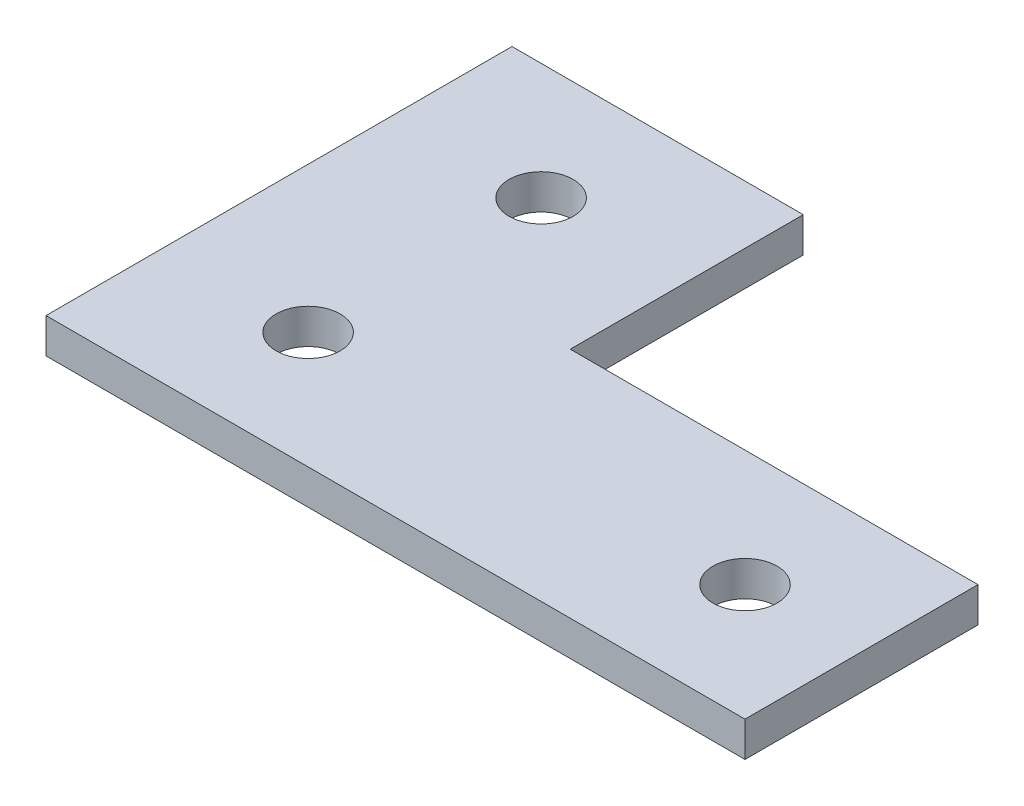
ISO-10303-21;
HEADER;
FILE_DESCRIPTION(('STEP AP214'),'2;1');
FILE_NAME('part.step','',(''),(''),'','','');
FILE_SCHEMA(('AUTOMOTIVE_DESIGN { 1 0 10303 214 1 1 1 1 }'));
ENDSEC;
DATA;
#1=APPLICATION_CONTEXT('core data for automotive mechanical design processes');
#2=APPLICATION_PROTOCOL_DEFINITION('international standard','automotive_design',2000,#1);
#3=PRODUCT_CONTEXT('',#1,'mechanical');
#4=PRODUCT('Part','Part','',(#3));
#5=PRODUCT_RELATED_PRODUCT_CATEGORY('part','',(#4));
#6=PRODUCT_DEFINITION_FORMATION('','',#4);
#7=PRODUCT_DEFINITION_CONTEXT('part definition',#1,'design');
#8=PRODUCT_DEFINITION('design','',#6,#7);
#9=PRODUCT_DEFINITION_SHAPE('','',#8);
#10=(LENGTH_UNIT() NAMED_UNIT(*) SI_UNIT(.MILLI.,.METRE.));
#11=(NAMED_UNIT(*) PLANE_ANGLE_UNIT() SI_UNIT($,.RADIAN.));
#12=(NAMED_UNIT(*) SI_UNIT($,.STERADIAN.) SOLID_ANGLE_UNIT());
#13=UNCERTAINTY_MEASURE_WITH_UNIT(LENGTH_MEASURE(1.E-05),#10,'distance_accuracy_value','');
#14=(GEOMETRIC_REPRESENTATION_CONTEXT(3) GLOBAL_UNCERTAINTY_ASSIGNED_CONTEXT((#13)) GLOBAL_UNIT_ASSIGNED_CONTEXT((#10,
#11,#12)) REPRESENTATION_CONTEXT('',''));
#15=CARTESIAN_POINT('',(0.,0.,0.));
#16=DIRECTION('',(0.,0.,1.));
#17=DIRECTION('',(1.,0.,0.));
#18=AXIS2_PLACEMENT_3D('',#15,#16,#17);
#19=CARTESIAN_POINT('',(25.,3.,0.));
#20=DIRECTION('',(1.,0.,0.));
#21=DIRECTION('',(0.,0.,-1.));
#22=AXIS2_PLACEMENT_3D('',#19,#20,#21);
#23=PLANE('',#22);
#24=DIRECTION('',(0.,0.,1.));
#25=VECTOR('',#24,1.);
#26=CARTESIAN_POINT('',(25.,0.,0.));
#27=LINE('',#26,#25);
#28=CARTESIAN_POINT('',(25.,0.,0.));
#29=VERTEX_POINT('',#28);
#30=CARTESIAN_POINT('',(25.,0.,20.));
#31=VERTEX_POINT('',#30);
#32=EDGE_CURVE('E123',#29,#31,#27,.T.);
#33=ORIENTED_EDGE('',*,*,#32,.F.);
#34=DIRECTION('',(0.,-1.,0.));
#35=VECTOR('',#34,1.);
#36=CARTESIAN_POINT('',(25.,3.,0.));
#37=LINE('',#36,#35);
#38=CARTESIAN_POINT('',(25.,3.,0.));
#39=VERTEX_POINT('',#38);
#40=EDGE_CURVE('E11',#39,#29,#37,.T.);
#41=ORIENTED_EDGE('',*,*,#40,.F.);
#42=DIRECTION('',(0.,0.,1.));
#43=VECTOR('',#42,1.);
#44=CARTESIAN_POINT('',(25.,3.,0.));
#45=LINE('',#44,#43);
#46=CARTESIAN_POINT('',(25.,3.,20.));
#47=VERTEX_POINT('',#46);
#48=EDGE_CURVE('E137',#39,#47,#45,.T.);
#49=ORIENTED_EDGE('',*,*,#48,.T.);
#50=DIRECTION('',(0.,-1.,0.));
#51=VECTOR('',#50,1.);
#52=CARTESIAN_POINT('',(25.,3.,20.));
#53=LINE('',#52,#51);
#54=EDGE_CURVE('E57',#47,#31,#53,.T.);
#55=ORIENTED_EDGE('',*,*,#54,.T.);
#56=EDGE_LOOP('',(#33,#41,#49,#55));
#57=FACE_BOUND('',#56,.T.);
#58=ADVANCED_FACE('F41',(#57),#23,.T.);
#59=CARTESIAN_POINT('',(0.,3.,0.));
#60=DIRECTION('',(0.,0.,-1.));
#61=DIRECTION('',(-1.,0.,0.));
#62=AXIS2_PLACEMENT_3D('',#59,#60,#61);
#63=PLANE('',#62);
#64=DIRECTION('',(1.,0.,0.));
#65=VECTOR('',#64,1.);
#66=CARTESIAN_POINT('',(0.,0.,0.));
#67=LINE('',#66,#65);
#68=CARTESIAN_POINT('',(0.,0.,0.));
#69=VERTEX_POINT('',#68);
#70=EDGE_CURVE('E125',#69,#29,#67,.T.);
#71=ORIENTED_EDGE('',*,*,#70,.F.);
#72=DIRECTION('',(0.,-1.,0.));
#73=VECTOR('',#72,1.);
#74=CARTESIAN_POINT('',(0.,3.,0.));
#75=LINE('',#74,#73);
#76=CARTESIAN_POINT('',(0.,3.,0.));
#77=VERTEX_POINT('',#76);
#78=EDGE_CURVE('E49',#77,#69,#75,.T.);
#79=ORIENTED_EDGE('',*,*,#78,.F.);
#80=DIRECTION('',(1.,0.,0.));
#81=VECTOR('',#80,1.);
#82=CARTESIAN_POINT('',(0.,3.,0.));
#83=LINE('',#82,#81);
#84=EDGE_CURVE('E149',#77,#39,#83,.T.);
#85=ORIENTED_EDGE('',*,*,#84,.T.);
#86=ORIENTED_EDGE('',*,*,#40,.T.);
#87=EDGE_LOOP('',(#71,#79,#85,#86));
#88=FACE_BOUND('',#87,.T.);
#89=ADVANCED_FACE('F148',(#88),#63,.T.);
#90=CARTESIAN_POINT('',(0.,3.,0.));
#91=DIRECTION('',(1.,0.,0.));
#92=DIRECTION('',(0.,0.,-1.));
#93=AXIS2_PLACEMENT_3D('',#90,#91,#92);
#94=PLANE('',#93);
#95=DIRECTION('',(0.,0.,1.));
#96=VECTOR('',#95,1.);
#97=CARTESIAN_POINT('',(0.,0.,0.));
#98=LINE('',#97,#96);
#99=CARTESIAN_POINT('',(0.,0.,40.));
#100=VERTEX_POINT('',#99);
#101=EDGE_CURVE('E129',#69,#100,#98,.T.);
#102=ORIENTED_EDGE('',*,*,#101,.T.);
#103=DIRECTION('',(0.,-1.,0.));
#104=VECTOR('',#103,1.);
#105=CARTESIAN_POINT('',(0.,3.,40.));
#106=LINE('',#105,#104);
#107=CARTESIAN_POINT('',(0.,3.,40.));
#108=VERTEX_POINT('',#107);
#109=EDGE_CURVE('E115',#108,#100,#106,.T.);
#110=ORIENTED_EDGE('',*,*,#109,.F.);
#111=DIRECTION('',(0.,0.,1.));
#112=VECTOR('',#111,1.);
#113=CARTESIAN_POINT('',(0.,3.,0.));
#114=LINE('',#113,#112);
#115=EDGE_CURVE('E103',#77,#108,#114,.T.);
#116=ORIENTED_EDGE('',*,*,#115,.F.);
#117=ORIENTED_EDGE('',*,*,#78,.T.);
#118=EDGE_LOOP('',(#102,#110,#116,#117));
#119=FACE_BOUND('',#118,.T.);
#120=ADVANCED_FACE('F142',(#119),#94,.F.);
#121=CARTESIAN_POINT('',(0.,3.,40.));
#122=DIRECTION('',(0.,0.,-1.));
#123=DIRECTION('',(-1.,0.,0.));
#124=AXIS2_PLACEMENT_3D('',#121,#122,#123);
#125=PLANE('',#124);
#126=DIRECTION('',(1.,0.,0.));
#127=VECTOR('',#126,1.);
#128=CARTESIAN_POINT('',(0.,0.,40.));
#129=LINE('',#128,#127);
#130=CARTESIAN_POINT('',(60.,0.,40.));
#131=VERTEX_POINT('',#130);
#132=EDGE_CURVE('E112',#100,#131,#129,.T.);
#133=ORIENTED_EDGE('',*,*,#132,.T.);
#134=DIRECTION('',(0.,-1.,0.));
#135=VECTOR('',#134,1.);
#136=CARTESIAN_POINT('',(60.,3.,40.));
#137=LINE('',#136,#135);
#138=CARTESIAN_POINT('',(60.,3.,40.));
#139=VERTEX_POINT('',#138);
#140=EDGE_CURVE('E109',#139,#131,#137,.T.);
#141=ORIENTED_EDGE('',*,*,#140,.F.);
#142=DIRECTION('',(1.,0.,0.));
#143=VECTOR('',#142,1.);
#144=CARTESIAN_POINT('',(0.,3.,40.));
#145=LINE('',#144,#143);
#146=EDGE_CURVE('E95',#108,#139,#145,.T.);
#147=ORIENTED_EDGE('',*,*,#146,.F.);
#148=ORIENTED_EDGE('',*,*,#109,.T.);
#149=EDGE_LOOP('',(#133,#141,#147,#148));
#150=FACE_BOUND('',#149,.T.);
#151=ADVANCED_FACE('F110',(#150),#125,.F.);
#152=CARTESIAN_POINT('',(60.,3.,0.));
#153=DIRECTION('',(-1.,0.,0.));
#154=DIRECTION('',(0.,0.,1.));
#155=AXIS2_PLACEMENT_3D('',#152,#153,#154);
#156=PLANE('',#155);
#157=DIRECTION('',(0.,0.,-1.));
#158=VECTOR('',#157,1.);
#159=CARTESIAN_POINT('',(60.,0.,0.));
#160=LINE('',#159,#158);
#161=CARTESIAN_POINT('',(60.,0.,20.));
#162=VERTEX_POINT('',#161);
#163=EDGE_CURVE('E132',#131,#162,#160,.T.);
#164=ORIENTED_EDGE('',*,*,#163,.T.);
#165=DIRECTION('',(0.,-1.,0.));
#166=VECTOR('',#165,1.);
#167=CARTESIAN_POINT('',(60.,3.,20.));
#168=LINE('',#167,#166);
#169=CARTESIAN_POINT('',(60.,3.,20.));
#170=VERTEX_POINT('',#169);
#171=EDGE_CURVE('E77',#170,#162,#168,.T.);
#172=ORIENTED_EDGE('',*,*,#171,.F.);
#173=DIRECTION('',(0.,0.,-1.));
#174=VECTOR('',#173,1.);
#175=CARTESIAN_POINT('',(60.,3.,0.));
#176=LINE('',#175,#174);
#177=EDGE_CURVE('E100',#139,#170,#176,.T.);
#178=ORIENTED_EDGE('',*,*,#177,.F.);
#179=ORIENTED_EDGE('',*,*,#140,.T.);
#180=EDGE_LOOP('',(#164,#172,#178,#179));
#181=FACE_BOUND('',#180,.T.);
#182=ADVANCED_FACE('F117',(#181),#156,.F.);
#183=CARTESIAN_POINT('',(0.,3.,20.));
#184=DIRECTION('',(0.,0.,-1.));
#185=DIRECTION('',(-1.,0.,0.));
#186=AXIS2_PLACEMENT_3D('',#183,#184,#185);
#187=PLANE('',#186);
#188=DIRECTION('',(1.,0.,0.));
#189=VECTOR('',#188,1.);
#190=CARTESIAN_POINT('',(0.,0.,20.));
#191=LINE('',#190,#189);
#192=EDGE_CURVE('E134',#31,#162,#191,.T.);
#193=ORIENTED_EDGE('',*,*,#192,.F.);
#194=ORIENTED_EDGE('',*,*,#54,.F.);
#195=DIRECTION('',(1.,0.,0.));
#196=VECTOR('',#195,1.);
#197=CARTESIAN_POINT('',(0.,3.,20.));
#198=LINE('',#197,#196);
#199=EDGE_CURVE('E118',#47,#170,#198,.T.);
#200=ORIENTED_EDGE('',*,*,#199,.T.);
#201=ORIENTED_EDGE('',*,*,#171,.T.);
#202=EDGE_LOOP('',(#193,#194,#200,#201));
#203=FACE_BOUND('',#202,.T.);
#204=ADVANCED_FACE('F150',(#203),#187,.T.);
#205=CARTESIAN_POINT('',(0.,3.,0.));
#206=DIRECTION('',(0.,1.,0.));
#207=DIRECTION('',(0.,0.,1.));
#208=AXIS2_PLACEMENT_3D('',#205,#206,#207);
#209=PLANE('',#208);
#210=CARTESIAN_POINT('',(12.5,3.,10.));
#211=DIRECTION('',(0.,1.,0.));
#212=DIRECTION('',(0.,0.,1.));
#213=AXIS2_PLACEMENT_3D('',#210,#211,#212);
#214=CIRCLE('',#213,2.75);
#215=CARTESIAN_POINT('',(12.5,3.,12.75));
#216=VERTEX_POINT('',#215);
#217=EDGE_CURVE('E244',#216,#216,#214,.T.);
#218=ORIENTED_EDGE('',*,*,#217,.F.);
#219=EDGE_LOOP('',(#218));
#220=FACE_BOUND('',#219,.T.);
#221=CARTESIAN_POINT('',(12.5,3.,30.));
#222=DIRECTION('',(0.,1.,0.));
#223=DIRECTION('',(0.,0.,1.));
#224=AXIS2_PLACEMENT_3D('',#221,#222,#223);
#225=CIRCLE('',#224,2.75);
#226=CARTESIAN_POINT('',(12.5,3.,32.75));
#227=VERTEX_POINT('',#226);
#228=EDGE_CURVE('E245',#227,#227,#225,.T.);
#229=ORIENTED_EDGE('',*,*,#228,.F.);
#230=EDGE_LOOP('',(#229));
#231=FACE_BOUND('',#230,.T.);
#232=CARTESIAN_POINT('',(50.,3.,30.));
#233=DIRECTION('',(0.,1.,0.));
#234=DIRECTION('',(0.,0.,1.));
#235=AXIS2_PLACEMENT_3D('',#232,#233,#234);
#236=CIRCLE('',#235,2.75);
#237=CARTESIAN_POINT('',(50.,3.,32.75));
#238=VERTEX_POINT('',#237);
#239=EDGE_CURVE('E254',#238,#238,#236,.T.);
#240=ORIENTED_EDGE('',*,*,#239,.F.);
#241=EDGE_LOOP('',(#240));
#242=FACE_BOUND('',#241,.T.);
#243=ORIENTED_EDGE('',*,*,#48,.F.);
#244=ORIENTED_EDGE('',*,*,#84,.F.);
#245=ORIENTED_EDGE('',*,*,#115,.T.);
#246=ORIENTED_EDGE('',*,*,#146,.T.);
#247=ORIENTED_EDGE('',*,*,#177,.T.);
#248=ORIENTED_EDGE('',*,*,#199,.F.);
#249=EDGE_LOOP('',(#243,#244,#245,#246,#247,#248));
#250=FACE_BOUND('',#249,.T.);
#251=ADVANCED_FACE('F97',(#220,#231,#242,#250),#209,.T.);
#252=CARTESIAN_POINT('',(0.,0.,0.));
#253=DIRECTION('',(0.,1.,0.));
#254=DIRECTION('',(0.,0.,1.));
#255=AXIS2_PLACEMENT_3D('',#252,#253,#254);
#256=PLANE('',#255);
#257=CARTESIAN_POINT('',(12.5,0.,10.));
#258=DIRECTION('',(0.,1.,0.));
#259=DIRECTION('',(0.,0.,1.));
#260=AXIS2_PLACEMENT_3D('',#257,#258,#259);
#261=CIRCLE('',#260,2.75);
#262=CARTESIAN_POINT('',(12.5,0.,12.75));
#263=VERTEX_POINT('',#262);
#264=EDGE_CURVE('E126',#263,#263,#261,.T.);
#265=ORIENTED_EDGE('',*,*,#264,.T.);
#266=EDGE_LOOP('',(#265));
#267=FACE_BOUND('',#266,.T.);
#268=CARTESIAN_POINT('',(12.5,0.,30.));
#269=DIRECTION('',(0.,1.,0.));
#270=DIRECTION('',(0.,0.,1.));
#271=AXIS2_PLACEMENT_3D('',#268,#269,#270);
#272=CIRCLE('',#271,2.75);
#273=CARTESIAN_POINT('',(12.5,0.,32.75));
#274=VERTEX_POINT('',#273);
#275=EDGE_CURVE('E249',#274,#274,#272,.T.);
#276=ORIENTED_EDGE('',*,*,#275,.T.);
#277=EDGE_LOOP('',(#276));
#278=FACE_BOUND('',#277,.T.);
#279=CARTESIAN_POINT('',(50.,0.,30.));
#280=DIRECTION('',(0.,1.,0.));
#281=DIRECTION('',(0.,0.,1.));
#282=AXIS2_PLACEMENT_3D('',#279,#280,#281);
#283=CIRCLE('',#282,2.75);
#284=CARTESIAN_POINT('',(50.,0.,32.75));
#285=VERTEX_POINT('',#284);
#286=EDGE_CURVE('E257',#285,#285,#283,.T.);
#287=ORIENTED_EDGE('',*,*,#286,.T.);
#288=EDGE_LOOP('',(#287));
#289=FACE_BOUND('',#288,.T.);
#290=ORIENTED_EDGE('',*,*,#32,.T.);
#291=ORIENTED_EDGE('',*,*,#192,.T.);
#292=ORIENTED_EDGE('',*,*,#163,.F.);
#293=ORIENTED_EDGE('',*,*,#132,.F.);
#294=ORIENTED_EDGE('',*,*,#101,.F.);
#295=ORIENTED_EDGE('',*,*,#70,.T.);
#296=EDGE_LOOP('',(#290,#291,#292,#293,#294,#295));
#297=FACE_BOUND('',#296,.T.);
#298=ADVANCED_FACE('F147',(#267,#278,#289,#297),#256,.F.);
#299=CARTESIAN_POINT('',(50.,0.,30.));
#300=DIRECTION('',(0.,1.,0.));
#301=DIRECTION('',(0.,0.,1.));
#302=AXIS2_PLACEMENT_3D('',#299,#300,#301);
#303=CYLINDRICAL_SURFACE('',#302,2.75);
#304=ORIENTED_EDGE('',*,*,#286,.F.);
#305=EDGE_LOOP('',(#304));
#306=FACE_BOUND('',#305,.T.);
#307=ORIENTED_EDGE('',*,*,#239,.T.);
#308=EDGE_LOOP('',(#307));
#309=FACE_BOUND('',#308,.T.);
#310=ADVANCED_FACE('F204',(#306,#309),#303,.F.);
#311=CARTESIAN_POINT('',(12.5,0.,30.));
#312=DIRECTION('',(0.,1.,0.));
#313=DIRECTION('',(0.,0.,1.));
#314=AXIS2_PLACEMENT_3D('',#311,#312,#313);
#315=CYLINDRICAL_SURFACE('',#314,2.75);
#316=ORIENTED_EDGE('',*,*,#275,.F.);
#317=EDGE_LOOP('',(#316));
#318=FACE_BOUND('',#317,.T.);
#319=ORIENTED_EDGE('',*,*,#228,.T.);
#320=EDGE_LOOP('',(#319));
#321=FACE_BOUND('',#320,.T.);
#322=ADVANCED_FACE('F216',(#318,#321),#315,.F.);
#323=CARTESIAN_POINT('',(12.5,0.,10.));
#324=DIRECTION('',(0.,1.,0.));
#325=DIRECTION('',(0.,0.,1.));
#326=AXIS2_PLACEMENT_3D('',#323,#324,#325);
#327=CYLINDRICAL_SURFACE('',#326,2.75);
#328=ORIENTED_EDGE('',*,*,#264,.F.);
#329=EDGE_LOOP('',(#328));
#330=FACE_BOUND('',#329,.T.);
#331=ORIENTED_EDGE('',*,*,#217,.T.);
#332=EDGE_LOOP('',(#331));
#333=FACE_BOUND('',#332,.T.);
#334=ADVANCED_FACE('F226',(#330,#333),#327,.F.);
#335=CLOSED_SHELL('',(#58,#89,#120,#151,#182,#204,#251,#298,#310,#322,#334));
#336=MANIFOLD_SOLID_BREP('B2',#335);
#337=ADVANCED_BREP_SHAPE_REPRESENTATION('',(#18,#336),#14);
#338=SHAPE_DEFINITION_REPRESENTATION(#9,#337);
ENDSEC;
END-ISO-10303-21;
